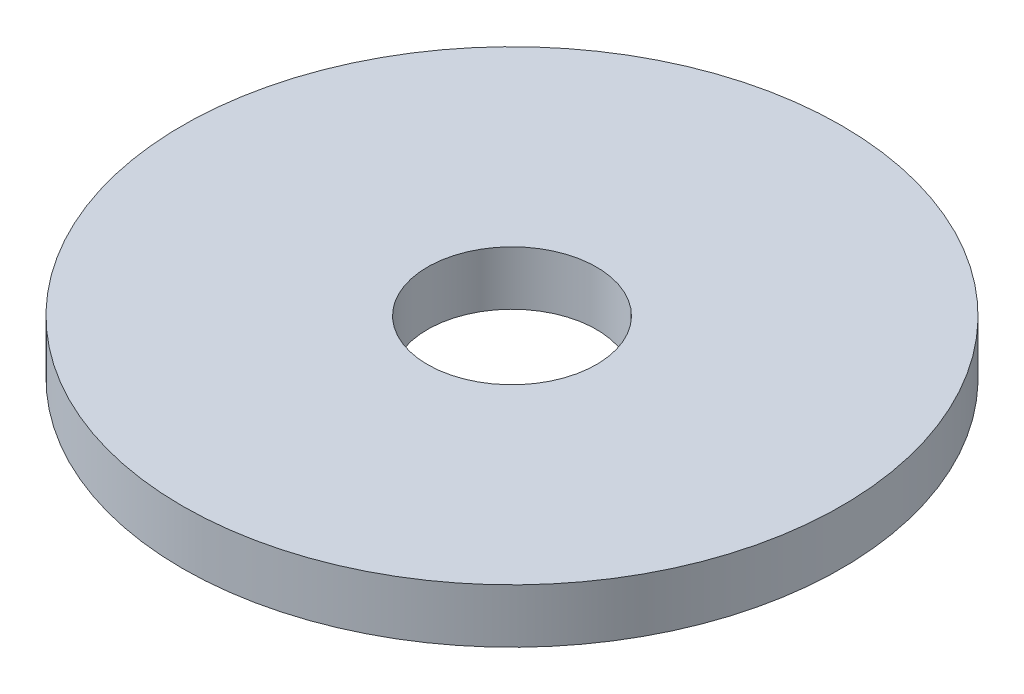
ISO-10303-21;
HEADER;
FILE_DESCRIPTION(('STEP AP214'),'2;1');
FILE_NAME('part.step','',(''),(''),'','','');
FILE_SCHEMA(('AUTOMOTIVE_DESIGN { 1 0 10303 214 1 1 1 1 }'));
ENDSEC;
DATA;
#1=APPLICATION_CONTEXT('core data for automotive mechanical design processes');
#2=APPLICATION_PROTOCOL_DEFINITION('international standard','automotive_design',2000,#1);
#3=PRODUCT_CONTEXT('',#1,'mechanical');
#4=PRODUCT('Part','Part','',(#3));
#5=PRODUCT_RELATED_PRODUCT_CATEGORY('part','',(#4));
#6=PRODUCT_DEFINITION_FORMATION('','',#4);
#7=PRODUCT_DEFINITION_CONTEXT('part definition',#1,'design');
#8=PRODUCT_DEFINITION('design','',#6,#7);
#9=PRODUCT_DEFINITION_SHAPE('','',#8);
#10=(LENGTH_UNIT() NAMED_UNIT(*) SI_UNIT(.MILLI.,.METRE.));
#11=(NAMED_UNIT(*) PLANE_ANGLE_UNIT() SI_UNIT($,.RADIAN.));
#12=(NAMED_UNIT(*) SI_UNIT($,.STERADIAN.) SOLID_ANGLE_UNIT());
#13=UNCERTAINTY_MEASURE_WITH_UNIT(LENGTH_MEASURE(1.E-05),#10,'distance_accuracy_value','');
#14=(GEOMETRIC_REPRESENTATION_CONTEXT(3) GLOBAL_UNCERTAINTY_ASSIGNED_CONTEXT((#13)) GLOBAL_UNIT_ASSIGNED_CONTEXT((#10,
#11,#12)) REPRESENTATION_CONTEXT('',''));
#15=CARTESIAN_POINT('',(0.,0.,0.));
#16=DIRECTION('',(0.,0.,1.));
#17=DIRECTION('',(1.,0.,0.));
#18=AXIS2_PLACEMENT_3D('',#15,#16,#17);
#19=CARTESIAN_POINT('',(0.,16.,0.));
#20=DIRECTION('',(0.,-1.,0.));
#21=DIRECTION('',(0.,0.,-1.));
#22=AXIS2_PLACEMENT_3D('',#19,#20,#21);
#23=CYLINDRICAL_SURFACE('',#22,97.5);
#24=CARTESIAN_POINT('',(0.,16.,0.));
#25=DIRECTION('',(0.,1.,0.));
#26=DIRECTION('',(0.,0.,1.));
#27=AXIS2_PLACEMENT_3D('',#24,#25,#26);
#28=CIRCLE('',#27,97.5);
#29=CARTESIAN_POINT('',(0.,16.,97.5));
#30=VERTEX_POINT('',#29);
#31=EDGE_CURVE('E10',#30,#30,#28,.T.);
#32=ORIENTED_EDGE('',*,*,#31,.F.);
#33=EDGE_LOOP('',(#32));
#34=FACE_BOUND('',#33,.T.);
#35=CARTESIAN_POINT('',(0.,0.,0.));
#36=DIRECTION('',(0.,1.,0.));
#37=DIRECTION('',(0.,0.,1.));
#38=AXIS2_PLACEMENT_3D('',#35,#36,#37);
#39=CIRCLE('',#38,97.5);
#40=CARTESIAN_POINT('',(0.,0.,97.5));
#41=VERTEX_POINT('',#40);
#42=EDGE_CURVE('E37',#41,#41,#39,.T.);
#43=ORIENTED_EDGE('',*,*,#42,.T.);
#44=EDGE_LOOP('',(#43));
#45=FACE_BOUND('',#44,.T.);
#46=ADVANCED_FACE('F40',(#34,#45),#23,.T.);
#47=CARTESIAN_POINT('',(0.,16.,0.));
#48=DIRECTION('',(0.,1.,0.));
#49=DIRECTION('',(0.,0.,1.));
#50=AXIS2_PLACEMENT_3D('',#47,#48,#49);
#51=PLANE('',#50);
#52=CARTESIAN_POINT('',(0.,16.,0.));
#53=DIRECTION('',(0.,1.,0.));
#54=DIRECTION('',(0.,0.,1.));
#55=AXIS2_PLACEMENT_3D('',#52,#53,#54);
#56=CIRCLE('',#55,25.);
#57=CARTESIAN_POINT('',(0.,16.,25.));
#58=VERTEX_POINT('',#57);
#59=EDGE_CURVE('E50',#58,#58,#56,.T.);
#60=ORIENTED_EDGE('',*,*,#59,.F.);
#61=EDGE_LOOP('',(#60));
#62=FACE_BOUND('',#61,.T.);
#63=ORIENTED_EDGE('',*,*,#31,.T.);
#64=EDGE_LOOP('',(#63));
#65=FACE_BOUND('',#64,.T.);
#66=ADVANCED_FACE('F59',(#62,#65),#51,.T.);
#67=CARTESIAN_POINT('',(0.,0.,0.));
#68=DIRECTION('',(0.,1.,0.));
#69=DIRECTION('',(0.,0.,1.));
#70=AXIS2_PLACEMENT_3D('',#67,#68,#69);
#71=PLANE('',#70);
#72=CARTESIAN_POINT('',(0.,0.,0.));
#73=DIRECTION('',(0.,1.,0.));
#74=DIRECTION('',(0.,0.,1.));
#75=AXIS2_PLACEMENT_3D('',#72,#73,#74);
#76=CIRCLE('',#75,25.);
#77=CARTESIAN_POINT('',(0.,0.,25.));
#78=VERTEX_POINT('',#77);
#79=EDGE_CURVE('E47',#78,#78,#76,.T.);
#80=ORIENTED_EDGE('',*,*,#79,.T.);
#81=EDGE_LOOP('',(#80));
#82=FACE_BOUND('',#81,.T.);
#83=ORIENTED_EDGE('',*,*,#42,.F.);
#84=EDGE_LOOP('',(#83));
#85=FACE_BOUND('',#84,.T.);
#86=ADVANCED_FACE('F58',(#82,#85),#71,.F.);
#87=CARTESIAN_POINT('',(0.,16.,0.));
#88=DIRECTION('',(0.,-1.,0.));
#89=DIRECTION('',(0.,0.,-1.));
#90=AXIS2_PLACEMENT_3D('',#87,#88,#89);
#91=CYLINDRICAL_SURFACE('',#90,25.);
#92=ORIENTED_EDGE('',*,*,#59,.T.);
#93=EDGE_LOOP('',(#92));
#94=FACE_BOUND('',#93,.T.);
#95=ORIENTED_EDGE('',*,*,#79,.F.);
#96=EDGE_LOOP('',(#95));
#97=FACE_BOUND('',#96,.T.);
#98=ADVANCED_FACE('F54',(#94,#97),#91,.F.);
#99=CLOSED_SHELL('',(#46,#66,#86,#98));
#100=MANIFOLD_SOLID_BREP('B2',#99);
#101=ADVANCED_BREP_SHAPE_REPRESENTATION('',(#18,#100),#14);
#102=SHAPE_DEFINITION_REPRESENTATION(#9,#101);
ENDSEC;
END-ISO-10303-21;
